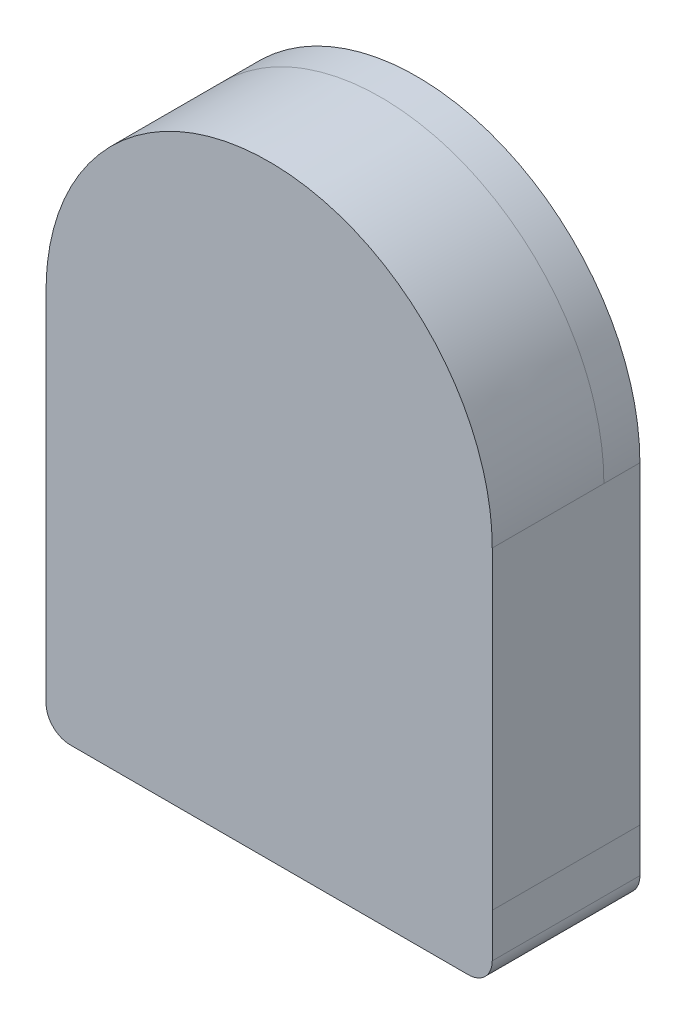
ISO-10303-21;
HEADER;
FILE_DESCRIPTION(('STEP AP214'),'2;1');
FILE_NAME('part.step','',(''),(''),'','','');
FILE_SCHEMA(('AUTOMOTIVE_DESIGN { 1 0 10303 214 1 1 1 1 }'));
ENDSEC;
DATA;
#1=APPLICATION_CONTEXT('core data for automotive mechanical design processes');
#2=APPLICATION_PROTOCOL_DEFINITION('international standard','automotive_design',2000,#1);
#3=PRODUCT_CONTEXT('',#1,'mechanical');
#4=PRODUCT('Part','Part','',(#3));
#5=PRODUCT_RELATED_PRODUCT_CATEGORY('part','',(#4));
#6=PRODUCT_DEFINITION_FORMATION('','',#4);
#7=PRODUCT_DEFINITION_CONTEXT('part definition',#1,'design');
#8=PRODUCT_DEFINITION('design','',#6,#7);
#9=PRODUCT_DEFINITION_SHAPE('','',#8);
#10=(LENGTH_UNIT() NAMED_UNIT(*) SI_UNIT(.MILLI.,.METRE.));
#11=(NAMED_UNIT(*) PLANE_ANGLE_UNIT() SI_UNIT($,.RADIAN.));
#12=(NAMED_UNIT(*) SI_UNIT($,.STERADIAN.) SOLID_ANGLE_UNIT());
#13=UNCERTAINTY_MEASURE_WITH_UNIT(LENGTH_MEASURE(1.E-05),#10,'distance_accuracy_value','');
#14=(GEOMETRIC_REPRESENTATION_CONTEXT(3) GLOBAL_UNCERTAINTY_ASSIGNED_CONTEXT((#13)) GLOBAL_UNIT_ASSIGNED_CONTEXT((#10,
#11,#12)) REPRESENTATION_CONTEXT('',''));
#15=CARTESIAN_POINT('',(0.,0.,0.));
#16=DIRECTION('',(0.,0.,1.));
#17=DIRECTION('',(1.,0.,0.));
#18=AXIS2_PLACEMENT_3D('',#15,#16,#17);
#19=CARTESIAN_POINT('',(8.29127246754,-14.8912724675,3.075));
#20=DIRECTION('',(0.,0.,-1.));
#21=DIRECTION('',(1.,0.,0.));
#22=AXIS2_PLACEMENT_3D('',#19,#20,#21);
#23=CYLINDRICAL_SURFACE('',#22,1.);
#24=CARTESIAN_POINT('',(8.29127246754,-14.8912724675,0.));
#25=DIRECTION('',(0.,0.,1.));
#26=DIRECTION('',(1.,0.,0.));
#27=AXIS2_PLACEMENT_3D('',#24,#25,#26);
#28=CIRCLE('',#27,1.);
#29=CARTESIAN_POINT('',(8.29127246754,-15.8912724675,0.));
#30=VERTEX_POINT('',#29);
#31=CARTESIAN_POINT('',(9.29127246754,-14.8912724675,0.));
#32=VERTEX_POINT('',#31);
#33=EDGE_CURVE('E11',#30,#32,#28,.T.);
#34=ORIENTED_EDGE('',*,*,#33,.T.);
#35=DIRECTION('',(0.,0.,-1.));
#36=VECTOR('',#35,1.);
#37=CARTESIAN_POINT('',(9.29127246754,-14.8912724675,3.075));
#38=LINE('',#37,#36);
#39=CARTESIAN_POINT('',(9.29127246754,-14.8912724675,6.15));
#40=VERTEX_POINT('',#39);
#41=EDGE_CURVE('E235',#40,#32,#38,.T.);
#42=ORIENTED_EDGE('',*,*,#41,.F.);
#43=CARTESIAN_POINT('',(8.29127246754,-14.8912724675,6.15));
#44=DIRECTION('',(0.,0.,-1.));
#45=DIRECTION('',(1.,0.,0.));
#46=AXIS2_PLACEMENT_3D('',#43,#44,#45);
#47=CIRCLE('',#46,1.);
#48=CARTESIAN_POINT('',(8.29127246754,-15.8912724675,6.15));
#49=VERTEX_POINT('',#48);
#50=EDGE_CURVE('E28',#40,#49,#47,.T.);
#51=ORIENTED_EDGE('',*,*,#50,.T.);
#52=DIRECTION('',(0.,0.,-1.));
#53=VECTOR('',#52,1.);
#54=CARTESIAN_POINT('',(8.29127246754,-15.8912724675,3.075));
#55=LINE('',#54,#53);
#56=EDGE_CURVE('E276',#49,#30,#55,.T.);
#57=ORIENTED_EDGE('',*,*,#56,.T.);
#58=EDGE_LOOP('',(#34,#42,#51,#57));
#59=FACE_BOUND('',#58,.T.);
#60=ADVANCED_FACE('F17',(#59),#23,.T.);
#61=CARTESIAN_POINT('',(0.,-3.3,0.));
#62=DIRECTION('',(0.,0.,1.));
#63=DIRECTION('',(1.,0.,0.));
#64=AXIS2_PLACEMENT_3D('',#61,#62,#63);
#65=PLANE('',#64);
#66=ORIENTED_EDGE('',*,*,#33,.F.);
#67=DIRECTION('',(1.,0.,0.));
#68=VECTOR('',#67,1.);
#69=CARTESIAN_POINT('',(6.67750706079,-15.8912724675,0.));
#70=LINE('',#69,#68);
#71=CARTESIAN_POINT('',(5.06374165404,-15.8912724675,0.));
#72=VERTEX_POINT('',#71);
#73=EDGE_CURVE('E191',#72,#30,#70,.T.);
#74=ORIENTED_EDGE('',*,*,#73,.F.);
#75=DIRECTION('',(1.,0.,0.));
#76=VECTOR('',#75,1.);
#77=CARTESIAN_POINT('',(0.00328049456473,-15.8912724675,0.));
#78=LINE('',#77,#76);
#79=CARTESIAN_POINT('',(-5.05718066429,-15.8912724675,0.));
#80=VERTEX_POINT('',#79);
#81=EDGE_CURVE('E247',#80,#72,#78,.T.);
#82=ORIENTED_EDGE('',*,*,#81,.F.);
#83=DIRECTION('',(1.,0.,0.));
#84=VECTOR('',#83,1.);
#85=CARTESIAN_POINT('',(-6.67422656592,-15.8912724675,0.));
#86=LINE('',#85,#84);
#87=CARTESIAN_POINT('',(-8.29127246754,-15.8912724675,0.));
#88=VERTEX_POINT('',#87);
#89=EDGE_CURVE('E160',#88,#80,#86,.T.);
#90=ORIENTED_EDGE('',*,*,#89,.F.);
#91=CARTESIAN_POINT('',(-8.29127246754,-14.8912724675,0.));
#92=DIRECTION('',(0.,0.,1.));
#93=DIRECTION('',(1.,0.,0.));
#94=AXIS2_PLACEMENT_3D('',#91,#92,#93);
#95=CIRCLE('',#94,1.);
#96=CARTESIAN_POINT('',(-9.29127246754,-14.8912724675,0.));
#97=VERTEX_POINT('',#96);
#98=EDGE_CURVE('E153',#97,#88,#95,.T.);
#99=ORIENTED_EDGE('',*,*,#98,.F.);
#100=DIRECTION('',(0.,-1.,0.));
#101=VECTOR('',#100,1.);
#102=CARTESIAN_POINT('',(-9.29127246754,-13.9425119181,0.));
#103=LINE('',#102,#101);
#104=CARTESIAN_POINT('',(-9.29127246754,-12.9937513688,0.));
#105=VERTEX_POINT('',#104);
#106=EDGE_CURVE('E157',#105,#97,#103,.T.);
#107=ORIENTED_EDGE('',*,*,#106,.F.);
#108=DIRECTION('',(0.,1.,0.));
#109=VECTOR('',#108,1.);
#110=CARTESIAN_POINT('',(-9.29127246754,-6.49687568471,0.));
#111=LINE('',#110,#109);
#112=CARTESIAN_POINT('',(-9.29127246754,0.,0.));
#113=VERTEX_POINT('',#112);
#114=EDGE_CURVE('E198',#105,#113,#111,.T.);
#115=ORIENTED_EDGE('',*,*,#114,.T.);
#116=CARTESIAN_POINT('',(0.,0.,0.));
#117=DIRECTION('',(0.,0.,1.));
#118=DIRECTION('',(1.,0.,0.));
#119=AXIS2_PLACEMENT_3D('',#116,#117,#118);
#120=CIRCLE('',#119,9.29127246754);
#121=CARTESIAN_POINT('',(9.29127246754,0.,0.));
#122=VERTEX_POINT('',#121);
#123=EDGE_CURVE('E263',#122,#113,#120,.T.);
#124=ORIENTED_EDGE('',*,*,#123,.F.);
#125=DIRECTION('',(0.,-1.,0.));
#126=VECTOR('',#125,1.);
#127=CARTESIAN_POINT('',(9.29127246754,-6.53289347638,0.));
#128=LINE('',#127,#126);
#129=CARTESIAN_POINT('',(9.29127246754,-13.0657869532,0.));
#130=VERTEX_POINT('',#129);
#131=EDGE_CURVE('E60',#122,#130,#128,.T.);
#132=ORIENTED_EDGE('',*,*,#131,.T.);
#133=DIRECTION('',(0.,1.,0.));
#134=VECTOR('',#133,1.);
#135=CARTESIAN_POINT('',(9.29127246754,-13.9785297104,0.));
#136=LINE('',#135,#134);
#137=EDGE_CURVE('E236',#32,#130,#136,.T.);
#138=ORIENTED_EDGE('',*,*,#137,.F.);
#139=EDGE_LOOP('',(#66,#74,#82,#90,#99,#107,#115,#124,#132,#138));
#140=FACE_BOUND('',#139,.T.);
#141=ADVANCED_FACE('F155',(#140),#65,.F.);
#142=CARTESIAN_POINT('',(0.,0.,6.15));
#143=DIRECTION('',(0.,0.,1.));
#144=DIRECTION('',(1.,0.,0.));
#145=AXIS2_PLACEMENT_3D('',#142,#143,#144);
#146=PLANE('',#145);
#147=DIRECTION('',(0.,1.,0.));
#148=VECTOR('',#147,1.);
#149=CARTESIAN_POINT('',(9.29127246754,-13.9785297104,6.15));
#150=LINE('',#149,#148);
#151=CARTESIAN_POINT('',(9.29127246754,-13.0657869532,6.15));
#152=VERTEX_POINT('',#151);
#153=EDGE_CURVE('E232',#40,#152,#150,.T.);
#154=ORIENTED_EDGE('',*,*,#153,.T.);
#155=DIRECTION('',(0.,1.,0.));
#156=VECTOR('',#155,1.);
#157=CARTESIAN_POINT('',(9.29127246754,-6.53289347666,6.15));
#158=LINE('',#157,#156);
#159=CARTESIAN_POINT('',(9.29127246754,-1.08640207941E-10,6.15));
#160=VERTEX_POINT('',#159);
#161=EDGE_CURVE('E199',#152,#160,#158,.T.);
#162=ORIENTED_EDGE('',*,*,#161,.T.);
#163=CARTESIAN_POINT('',(9.29127246754,-1.0863723428E-10,6.15));
#164=CARTESIAN_POINT('',(9.29127246754,1.45946966633,6.15));
#165=CARTESIAN_POINT('',(9.00470626867,2.91893933265,6.15));
#166=CARTESIAN_POINT('',(8.43129066116,4.30328706918,6.15));
#167=CARTESIAN_POINT('',(6.77255467012,6.77255467012,6.15));
#168=CARTESIAN_POINT('',(4.30328706918,8.43129066116,6.15));
#169=CARTESIAN_POINT('',(2.91893933265,9.00470626867,6.15));
#170=CARTESIAN_POINT('',(0.,9.5778386664,6.15));
#171=CARTESIAN_POINT('',(-2.91893933265,9.00470626867,6.15));
#172=CARTESIAN_POINT('',(-4.30328706918,8.43129066116,6.15));
#173=CARTESIAN_POINT('',(-6.77255467012,6.77255467012,6.15));
#174=CARTESIAN_POINT('',(-8.43129066116,4.30328706918,6.15));
#175=CARTESIAN_POINT('',(-9.00470626867,2.91893933265,6.15));
#176=CARTESIAN_POINT('',(-9.29127246754,1.45946966633,6.15));
#177=CARTESIAN_POINT('',(-9.29127246754,0.,6.15));
#178=(BOUNDED_CURVE() B_SPLINE_CURVE(5,(#163,#164,#165,#166,#167,#168,#169,#170,#171,#172,#173,
#174,#175,#176,#177),.UNSPECIFIED.,.F.,.F.) B_SPLINE_CURVE_WITH_KNOTS((6,3,3,3,6),
(-47.0355013243,-39.7381529927,-32.4408046611,-25.1434563295,-17.8461079978),
.UNSPECIFIED.) CURVE() GEOMETRIC_REPRESENTATION_ITEM() RATIONAL_B_SPLINE_CURVE((1.,1.,1.,1.,1.,
1.,1.,1.,1.,1.,1.,1.,1.,1.,1.)) REPRESENTATION_ITEM(''));
#179=CARTESIAN_POINT('',(-9.29127246754,0.,6.15));
#180=VERTEX_POINT('',#179);
#181=EDGE_CURVE('E258',#160,#180,#178,.T.);
#182=ORIENTED_EDGE('',*,*,#181,.T.);
#183=DIRECTION('',(0.,-1.,0.));
#184=VECTOR('',#183,1.);
#185=CARTESIAN_POINT('',(-9.29127246754,-6.49687568438,6.15));
#186=LINE('',#185,#184);
#187=CARTESIAN_POINT('',(-9.29127246754,-12.9937513688,6.15));
#188=VERTEX_POINT('',#187);
#189=EDGE_CURVE('E74',#180,#188,#186,.T.);
#190=ORIENTED_EDGE('',*,*,#189,.T.);
#191=DIRECTION('',(0.,-1.,0.));
#192=VECTOR('',#191,1.);
#193=CARTESIAN_POINT('',(-9.29127246754,-13.9425119181,6.15));
#194=LINE('',#193,#192);
#195=CARTESIAN_POINT('',(-9.29127246754,-14.8912724675,6.15));
#196=VERTEX_POINT('',#195);
#197=EDGE_CURVE('E178',#188,#196,#194,.T.);
#198=ORIENTED_EDGE('',*,*,#197,.T.);
#199=CARTESIAN_POINT('',(-8.29127246754,-14.8912724675,6.15));
#200=DIRECTION('',(0.,0.,-1.));
#201=DIRECTION('',(1.,0.,0.));
#202=AXIS2_PLACEMENT_3D('',#199,#200,#201);
#203=CIRCLE('',#202,1.);
#204=CARTESIAN_POINT('',(-8.29127246754,-15.8912724675,6.15));
#205=VERTEX_POINT('',#204);
#206=EDGE_CURVE('E165',#205,#196,#203,.T.);
#207=ORIENTED_EDGE('',*,*,#206,.F.);
#208=DIRECTION('',(1.,0.,0.));
#209=VECTOR('',#208,1.);
#210=CARTESIAN_POINT('',(-6.67422656592,-15.8912724675,6.15));
#211=LINE('',#210,#209);
#212=CARTESIAN_POINT('',(-5.05718066429,-15.8912724675,6.15));
#213=VERTEX_POINT('',#212);
#214=EDGE_CURVE('E194',#205,#213,#211,.T.);
#215=ORIENTED_EDGE('',*,*,#214,.T.);
#216=DIRECTION('',(1.,0.,0.));
#217=VECTOR('',#216,1.);
#218=CARTESIAN_POINT('',(0.00328049487454,-15.8912724675,6.15));
#219=LINE('',#218,#217);
#220=CARTESIAN_POINT('',(5.06374165404,-15.8912724675,6.15));
#221=VERTEX_POINT('',#220);
#222=EDGE_CURVE('E249',#213,#221,#219,.T.);
#223=ORIENTED_EDGE('',*,*,#222,.T.);
#224=DIRECTION('',(1.,0.,0.));
#225=VECTOR('',#224,1.);
#226=CARTESIAN_POINT('',(6.67750706079,-15.8912724675,6.15));
#227=LINE('',#226,#225);
#228=EDGE_CURVE('E188',#221,#49,#227,.T.);
#229=ORIENTED_EDGE('',*,*,#228,.T.);
#230=ORIENTED_EDGE('',*,*,#50,.F.);
#231=EDGE_LOOP('',(#154,#162,#182,#190,#198,#207,#215,#223,#229,#230));
#232=FACE_BOUND('',#231,.T.);
#233=ADVANCED_FACE('F309',(#232),#146,.T.);
#234=CARTESIAN_POINT('',(9.29127246754,-13.0657869525,0.));
#235=DIRECTION('',(1.,0.,0.));
#236=DIRECTION('',(0.,-1.,0.));
#237=AXIS2_PLACEMENT_3D('',#234,#235,#236);
#238=PLANE('',#237);
#239=ORIENTED_EDGE('',*,*,#137,.T.);
#240=DIRECTION('',(0.,0.,-1.));
#241=VECTOR('',#240,1.);
#242=CARTESIAN_POINT('',(9.29127246754,-13.0657869525,3.075));
#243=LINE('',#242,#241);
#244=EDGE_CURVE('E195',#152,#130,#243,.T.);
#245=ORIENTED_EDGE('',*,*,#244,.F.);
#246=ORIENTED_EDGE('',*,*,#153,.F.);
#247=ORIENTED_EDGE('',*,*,#41,.T.);
#248=EDGE_LOOP('',(#239,#245,#246,#247));
#249=FACE_BOUND('',#248,.T.);
#250=ADVANCED_FACE('F412',(#249),#238,.T.);
#251=CARTESIAN_POINT('',(-5.0571806643,-15.8912724675,0.));
#252=DIRECTION('',(0.,-1.,0.));
#253=DIRECTION('',(0.,0.,-1.));
#254=AXIS2_PLACEMENT_3D('',#251,#252,#253);
#255=PLANE('',#254);
#256=ORIENTED_EDGE('',*,*,#228,.F.);
#257=DIRECTION('',(0.,0.,-1.));
#258=VECTOR('',#257,1.);
#259=CARTESIAN_POINT('',(5.06374165404,-15.8912724675,3.825));
#260=LINE('',#259,#258);
#261=CARTESIAN_POINT('',(5.06374165404,-15.8912724675,1.5));
#262=VERTEX_POINT('',#261);
#263=EDGE_CURVE('E252',#221,#262,#260,.T.);
#264=ORIENTED_EDGE('',*,*,#263,.T.);
#265=DIRECTION('',(0.,0.,-1.));
#266=VECTOR('',#265,1.);
#267=CARTESIAN_POINT('',(5.06374165343,-15.8912724675,0.75));
#268=LINE('',#267,#266);
#269=EDGE_CURVE('E256',#262,#72,#268,.T.);
#270=ORIENTED_EDGE('',*,*,#269,.T.);
#271=ORIENTED_EDGE('',*,*,#73,.T.);
#272=ORIENTED_EDGE('',*,*,#56,.F.);
#273=EDGE_LOOP('',(#256,#264,#270,#271,#272));
#274=FACE_BOUND('',#273,.T.);
#275=ADVANCED_FACE('F425',(#274),#255,.T.);
#276=CARTESIAN_POINT('',(-8.29127246754,-14.8912724675,3.075));
#277=DIRECTION('',(0.,0.,-1.));
#278=DIRECTION('',(0.,-1.,0.));
#279=AXIS2_PLACEMENT_3D('',#276,#277,#278);
#280=CYLINDRICAL_SURFACE('',#279,1.);
#281=ORIENTED_EDGE('',*,*,#98,.T.);
#282=DIRECTION('',(0.,0.,-1.));
#283=VECTOR('',#282,1.);
#284=CARTESIAN_POINT('',(-8.29127246754,-15.8912724675,3.075));
#285=LINE('',#284,#283);
#286=EDGE_CURVE('E166',#205,#88,#285,.T.);
#287=ORIENTED_EDGE('',*,*,#286,.F.);
#288=ORIENTED_EDGE('',*,*,#206,.T.);
#289=DIRECTION('',(0.,0.,-1.));
#290=VECTOR('',#289,1.);
#291=CARTESIAN_POINT('',(-9.29127246754,-14.8912724675,3.075));
#292=LINE('',#291,#290);
#293=EDGE_CURVE('E169',#196,#97,#292,.T.);
#294=ORIENTED_EDGE('',*,*,#293,.T.);
#295=EDGE_LOOP('',(#281,#287,#288,#294));
#296=FACE_BOUND('',#295,.T.);
#297=ADVANCED_FACE('F170',(#296),#280,.T.);
#298=CARTESIAN_POINT('',(-5.0571806643,-15.8912724675,0.));
#299=DIRECTION('',(0.,-1.,0.));
#300=DIRECTION('',(0.,0.,-1.));
#301=AXIS2_PLACEMENT_3D('',#298,#299,#300);
#302=PLANE('',#301);
#303=ORIENTED_EDGE('',*,*,#89,.T.);
#304=DIRECTION('',(0.,0.,-1.));
#305=VECTOR('',#304,1.);
#306=CARTESIAN_POINT('',(-5.0571806643,-15.8912724675,0.75));
#307=LINE('',#306,#305);
#308=CARTESIAN_POINT('',(-5.0571806643,-15.8912724675,1.5));
#309=VERTEX_POINT('',#308);
#310=EDGE_CURVE('E243',#309,#80,#307,.T.);
#311=ORIENTED_EDGE('',*,*,#310,.F.);
#312=DIRECTION('',(0.,0.,-1.));
#313=VECTOR('',#312,1.);
#314=CARTESIAN_POINT('',(-5.05718066429,-15.8912724675,3.825));
#315=LINE('',#314,#313);
#316=EDGE_CURVE('E239',#213,#309,#315,.T.);
#317=ORIENTED_EDGE('',*,*,#316,.F.);
#318=ORIENTED_EDGE('',*,*,#214,.F.);
#319=ORIENTED_EDGE('',*,*,#286,.T.);
#320=EDGE_LOOP('',(#303,#311,#317,#318,#319));
#321=FACE_BOUND('',#320,.T.);
#322=ADVANCED_FACE('F301',(#321),#302,.T.);
#323=CARTESIAN_POINT('',(-9.29127246754,0.,0.));
#324=DIRECTION('',(-1.,0.,0.));
#325=DIRECTION('',(0.,1.,0.));
#326=AXIS2_PLACEMENT_3D('',#323,#324,#325);
#327=PLANE('',#326);
#328=ORIENTED_EDGE('',*,*,#197,.F.);
#329=DIRECTION('',(0.,0.,-1.));
#330=VECTOR('',#329,1.);
#331=CARTESIAN_POINT('',(-9.29127246754,-12.9937513688,3.075));
#332=LINE('',#331,#330);
#333=EDGE_CURVE('E175',#188,#105,#332,.T.);
#334=ORIENTED_EDGE('',*,*,#333,.T.);
#335=ORIENTED_EDGE('',*,*,#106,.T.);
#336=ORIENTED_EDGE('',*,*,#293,.F.);
#337=EDGE_LOOP('',(#328,#334,#335,#336));
#338=FACE_BOUND('',#337,.T.);
#339=ADVANCED_FACE('F19',(#338),#327,.T.);
#340=CARTESIAN_POINT('',(-9.29127246754,0.,0.));
#341=DIRECTION('',(-1.,0.,0.));
#342=DIRECTION('',(0.,1.,0.));
#343=AXIS2_PLACEMENT_3D('',#340,#341,#342);
#344=PLANE('',#343);
#345=ORIENTED_EDGE('',*,*,#114,.F.);
#346=ORIENTED_EDGE('',*,*,#333,.F.);
#347=ORIENTED_EDGE('',*,*,#189,.F.);
#348=DIRECTION('',(0.,0.,1.));
#349=VECTOR('',#348,1.);
#350=CARTESIAN_POINT('',(-9.29127246754,0.,3.825));
#351=LINE('',#350,#349);
#352=CARTESIAN_POINT('',(-9.29127246754,0.,1.5));
#353=VERTEX_POINT('',#352);
#354=EDGE_CURVE('E264',#353,#180,#351,.T.);
#355=ORIENTED_EDGE('',*,*,#354,.F.);
#356=DIRECTION('',(0.,0.,1.));
#357=VECTOR('',#356,1.);
#358=CARTESIAN_POINT('',(-9.29127246754,0.,0.));
#359=LINE('',#358,#357);
#360=EDGE_CURVE('E87',#113,#353,#359,.T.);
#361=ORIENTED_EDGE('',*,*,#360,.F.);
#362=EDGE_LOOP('',(#345,#346,#347,#355,#361));
#363=FACE_BOUND('',#362,.T.);
#364=ADVANCED_FACE('F311',(#363),#344,.T.);
#365=CARTESIAN_POINT('',(9.29127246754,-13.0657869525,0.));
#366=DIRECTION('',(1.,0.,0.));
#367=DIRECTION('',(0.,-1.,0.));
#368=AXIS2_PLACEMENT_3D('',#365,#366,#367);
#369=PLANE('',#368);
#370=ORIENTED_EDGE('',*,*,#131,.F.);
#371=DIRECTION('',(0.,0.,1.));
#372=VECTOR('',#371,1.);
#373=CARTESIAN_POINT('',(9.29127246754,0.,0.));
#374=LINE('',#373,#372);
#375=CARTESIAN_POINT('',(9.29127246754,-1.08640207941E-10,1.5));
#376=VERTEX_POINT('',#375);
#377=EDGE_CURVE('E244',#122,#376,#374,.T.);
#378=ORIENTED_EDGE('',*,*,#377,.T.);
#379=DIRECTION('',(0.,0.,1.));
#380=VECTOR('',#379,1.);
#381=CARTESIAN_POINT('',(9.29127246754,-1.08633546603E-10,3.825));
#382=LINE('',#381,#380);
#383=EDGE_CURVE('E385',#376,#160,#382,.T.);
#384=ORIENTED_EDGE('',*,*,#383,.T.);
#385=ORIENTED_EDGE('',*,*,#161,.F.);
#386=ORIENTED_EDGE('',*,*,#244,.T.);
#387=EDGE_LOOP('',(#370,#378,#384,#385,#386));
#388=FACE_BOUND('',#387,.T.);
#389=ADVANCED_FACE('F221',(#388),#369,.T.);
#390=CARTESIAN_POINT('',(-5.0571806643,-15.8912724675,0.));
#391=DIRECTION('',(0.,-1.,0.));
#392=DIRECTION('',(0.,0.,-1.));
#393=AXIS2_PLACEMENT_3D('',#390,#391,#392);
#394=PLANE('',#393);
#395=ORIENTED_EDGE('',*,*,#316,.T.);
#396=ORIENTED_EDGE('',*,*,#310,.T.);
#397=ORIENTED_EDGE('',*,*,#81,.T.);
#398=ORIENTED_EDGE('',*,*,#269,.F.);
#399=ORIENTED_EDGE('',*,*,#263,.F.);
#400=ORIENTED_EDGE('',*,*,#222,.F.);
#401=EDGE_LOOP('',(#395,#396,#397,#398,#399,#400));
#402=FACE_BOUND('',#401,.T.);
#403=ADVANCED_FACE('F306',(#402),#394,.T.);
#404=CARTESIAN_POINT('',(0.,0.,0.));
#405=DIRECTION('',(0.,0.,1.));
#406=DIRECTION('',(1.,0.,0.));
#407=AXIS2_PLACEMENT_3D('',#404,#405,#406);
#408=CYLINDRICAL_SURFACE('',#407,9.29127246754);
#409=ORIENTED_EDGE('',*,*,#123,.T.);
#410=ORIENTED_EDGE('',*,*,#360,.T.);
#411=CARTESIAN_POINT('',(9.29127246754,-1.0863723428E-10,1.5));
#412=CARTESIAN_POINT('',(9.29127246754,1.45946966633,1.5));
#413=CARTESIAN_POINT('',(9.00470626867,2.91893933265,1.5));
#414=CARTESIAN_POINT('',(8.43129066116,4.30328706918,1.5));
#415=CARTESIAN_POINT('',(6.77255467012,6.77255467012,1.5));
#416=CARTESIAN_POINT('',(4.30328706918,8.43129066116,1.5));
#417=CARTESIAN_POINT('',(2.91893933265,9.00470626867,1.5));
#418=CARTESIAN_POINT('',(0.,9.5778386664,1.5));
#419=CARTESIAN_POINT('',(-2.91893933265,9.00470626867,1.5));
#420=CARTESIAN_POINT('',(-4.30328706918,8.43129066116,1.5));
#421=CARTESIAN_POINT('',(-6.77255467012,6.77255467012,1.5));
#422=CARTESIAN_POINT('',(-8.43129066116,4.30328706918,1.5));
#423=CARTESIAN_POINT('',(-9.00470626867,2.91893933265,1.5));
#424=CARTESIAN_POINT('',(-9.29127246754,1.45946966633,1.5));
#425=CARTESIAN_POINT('',(-9.29127246754,0.,1.5));
#426=(BOUNDED_CURVE() B_SPLINE_CURVE(5,(#411,#412,#413,#414,#415,#416,#417,#418,#419,#420,#421,
#422,#423,#424,#425),.UNSPECIFIED.,.F.,.F.) B_SPLINE_CURVE_WITH_KNOTS((6,3,3,3,6),(0.,
7.433822163,14.8676443261,22.30146648915,29.7352886522),
.UNSPECIFIED.) CURVE() GEOMETRIC_REPRESENTATION_ITEM() RATIONAL_B_SPLINE_CURVE((1.,1.,1.,1.,1.,
1.,1.,1.,1.,1.,1.,1.,1.,1.,1.)) REPRESENTATION_ITEM(''));
#427=EDGE_CURVE('E205',#376,#353,#426,.T.);
#428=ORIENTED_EDGE('',*,*,#427,.F.);
#429=ORIENTED_EDGE('',*,*,#377,.F.);
#430=EDGE_LOOP('',(#409,#410,#428,#429));
#431=FACE_BOUND('',#430,.T.);
#432=ADVANCED_FACE('F220',(#431),#408,.T.);
#433=CARTESIAN_POINT('',(-9.29127246754,0.,1.5));
#434=CARTESIAN_POINT('',(-9.29127246754,1.45946966633,1.5));
#435=CARTESIAN_POINT('',(-9.00470626867,2.91893933265,1.5));
#436=CARTESIAN_POINT('',(-8.43129066116,4.30328706918,1.5));
#437=CARTESIAN_POINT('',(-6.77255467012,6.77255467012,1.5));
#438=CARTESIAN_POINT('',(-4.30328706918,8.43129066116,1.5));
#439=CARTESIAN_POINT('',(-2.91893933265,9.00470626867,1.5));
#440=CARTESIAN_POINT('',(0.,9.5778386664,1.5));
#441=CARTESIAN_POINT('',(2.91893933265,9.00470626867,1.5));
#442=CARTESIAN_POINT('',(4.30328706918,8.43129066116,1.5));
#443=CARTESIAN_POINT('',(6.77255467012,6.77255467012,1.5));
#444=CARTESIAN_POINT('',(8.43129066116,4.30328706918,1.5));
#445=CARTESIAN_POINT('',(9.00470626867,2.91893933265,1.5));
#446=CARTESIAN_POINT('',(9.29127246754,1.45946966633,1.5));
#447=CARTESIAN_POINT('',(9.29127246754,-1.0863723428E-10,1.5));
#448=(BOUNDED_CURVE() B_SPLINE_CURVE(5,(#433,#434,#435,#436,#437,#438,#439,#440,#441,#442,#443,
#444,#445,#446,#447),.UNSPECIFIED.,.F.,.F.) B_SPLINE_CURVE_WITH_KNOTS((6,3,3,3,6),(0.,
7.43382216305,14.8676443261,22.3014664892,29.7352886522),
.UNSPECIFIED.) CURVE() GEOMETRIC_REPRESENTATION_ITEM() RATIONAL_B_SPLINE_CURVE((1.,1.,1.,1.,1.,
1.,1.,1.,1.,1.,1.,1.,1.,1.,1.)) REPRESENTATION_ITEM(''));
#449=DIRECTION('',(0.,0.,1.));
#450=VECTOR('',#449,1.);
#451=SURFACE_OF_LINEAR_EXTRUSION('',#448,#450);
#452=ORIENTED_EDGE('',*,*,#383,.F.);
#453=ORIENTED_EDGE('',*,*,#427,.T.);
#454=ORIENTED_EDGE('',*,*,#354,.T.);
#455=ORIENTED_EDGE('',*,*,#181,.F.);
#456=EDGE_LOOP('',(#452,#453,#454,#455));
#457=FACE_BOUND('',#456,.T.);
#458=ADVANCED_FACE('F210',(#457),#451,.F.);
#459=CLOSED_SHELL('',(#60,#141,#233,#250,#275,#297,#322,#339,#364,#389,#403,#432,#458));
#460=MANIFOLD_SOLID_BREP('B1',#459);
#461=ADVANCED_BREP_SHAPE_REPRESENTATION('',(#18,#460),#14);
#462=SHAPE_DEFINITION_REPRESENTATION(#9,#461);
ENDSEC;
END-ISO-10303-21;
